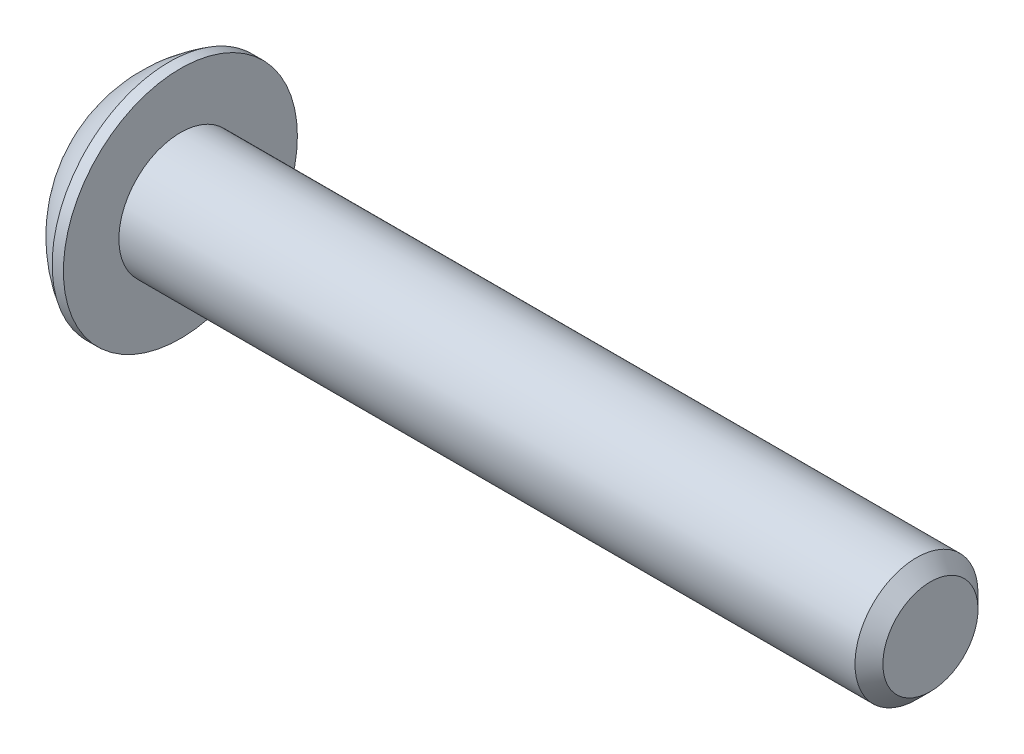
ISO-10303-21;
HEADER;
FILE_DESCRIPTION(('STEP AP214'),'2;1');
FILE_NAME('part.step','',(''),(''),'','','');
FILE_SCHEMA(('AUTOMOTIVE_DESIGN { 1 0 10303 214 1 1 1 1 }'));
ENDSEC;
DATA;
#1=APPLICATION_CONTEXT('core data for automotive mechanical design processes');
#2=APPLICATION_PROTOCOL_DEFINITION('international standard','automotive_design',2000,#1);
#3=PRODUCT_CONTEXT('',#1,'mechanical');
#4=PRODUCT('Part','Part','',(#3));
#5=PRODUCT_RELATED_PRODUCT_CATEGORY('part','',(#4));
#6=PRODUCT_DEFINITION_FORMATION('','',#4);
#7=PRODUCT_DEFINITION_CONTEXT('part definition',#1,'design');
#8=PRODUCT_DEFINITION('design','',#6,#7);
#9=PRODUCT_DEFINITION_SHAPE('','',#8);
#10=(LENGTH_UNIT() NAMED_UNIT(*) SI_UNIT(.MILLI.,.METRE.));
#11=(NAMED_UNIT(*) PLANE_ANGLE_UNIT() SI_UNIT($,.RADIAN.));
#12=(NAMED_UNIT(*) SI_UNIT($,.STERADIAN.) SOLID_ANGLE_UNIT());
#13=UNCERTAINTY_MEASURE_WITH_UNIT(LENGTH_MEASURE(1.E-05),#10,'distance_accuracy_value','');
#14=(GEOMETRIC_REPRESENTATION_CONTEXT(3) GLOBAL_UNCERTAINTY_ASSIGNED_CONTEXT((#13)) GLOBAL_UNIT_ASSIGNED_CONTEXT((#10,
#11,#12)) REPRESENTATION_CONTEXT('',''));
#15=CARTESIAN_POINT('',(0.,0.,0.));
#16=DIRECTION('',(0.,0.,1.));
#17=DIRECTION('',(1.,0.,0.));
#18=AXIS2_PLACEMENT_3D('',#15,#16,#17);
#19=CARTESIAN_POINT('',(1.32080000000034,0.,0.));
#20=DIRECTION('',(-1.,0.,0.));
#21=DIRECTION('',(0.,0.,-1.));
#22=AXIS2_PLACEMENT_3D('',#19,#20,#21);
#23=CONICAL_SURFACE('',#22,1.1937999999998,1.04719755119608);
#24=CARTESIAN_POINT('',(2.01004075135902,0.,-4.44089209850063E-13));
#25=VERTEX_POINT('',#24);
#26=VERTEX_LOOP('',#25);
#27=FACE_BOUND('',#26,.T.);
#28=CARTESIAN_POINT('',(1.32080000000009,0.,0.));
#29=DIRECTION('',(1.,0.,0.));
#30=DIRECTION('',(0.,0.,-1.));
#31=AXIS2_PLACEMENT_3D('',#28,#29,#30);
#32=CIRCLE('',#31,1.19380000000024);
#33=CARTESIAN_POINT('',(1.32080000000004,-1.03386112703797,-0.59690000000006));
#34=VERTEX_POINT('',#33);
#35=CARTESIAN_POINT('',(1.32080000000004,0.,-1.19380000000012));
#36=VERTEX_POINT('',#35);
#37=EDGE_CURVE('E37',#34,#36,#32,.T.);
#38=ORIENTED_EDGE('',*,*,#37,.F.);
#39=CARTESIAN_POINT('',(1.32080000000009,0.,0.));
#40=DIRECTION('',(1.,0.,0.));
#41=DIRECTION('',(0.,0.,-1.));
#42=AXIS2_PLACEMENT_3D('',#39,#40,#41);
#43=CIRCLE('',#42,1.19380000000024);
#44=CARTESIAN_POINT('',(1.32080000000004,-1.03386112703797,0.59690000000006));
#45=VERTEX_POINT('',#44);
#46=EDGE_CURVE('E127',#45,#34,#43,.T.);
#47=ORIENTED_EDGE('',*,*,#46,.F.);
#48=CARTESIAN_POINT('',(1.32080000000009,0.,0.));
#49=DIRECTION('',(1.,0.,0.));
#50=DIRECTION('',(0.,0.,-1.));
#51=AXIS2_PLACEMENT_3D('',#48,#49,#50);
#52=CIRCLE('',#51,1.19380000000024);
#53=CARTESIAN_POINT('',(1.32080000000004,1.49457637585666E-12,1.19380000000012));
#54=VERTEX_POINT('',#53);
#55=EDGE_CURVE('E133',#54,#45,#52,.T.);
#56=ORIENTED_EDGE('',*,*,#55,.F.);
#57=CARTESIAN_POINT('',(1.32080000000009,0.,0.));
#58=DIRECTION('',(1.,0.,0.));
#59=DIRECTION('',(0.,0.,-1.));
#60=AXIS2_PLACEMENT_3D('',#57,#58,#59);
#61=CIRCLE('',#60,1.19380000000024);
#62=CARTESIAN_POINT('',(1.32080000000004,1.03386112703797,0.596900000000061));
#63=VERTEX_POINT('',#62);
#64=EDGE_CURVE('E147',#63,#54,#61,.T.);
#65=ORIENTED_EDGE('',*,*,#64,.F.);
#66=CARTESIAN_POINT('',(1.32080000000009,0.,0.));
#67=DIRECTION('',(1.,0.,0.));
#68=DIRECTION('',(0.,0.,-1.));
#69=AXIS2_PLACEMENT_3D('',#66,#67,#68);
#70=CIRCLE('',#69,1.19380000000024);
#71=CARTESIAN_POINT('',(1.32080000000004,1.03386112703797,-0.596900000000061));
#72=VERTEX_POINT('',#71);
#73=EDGE_CURVE('E140',#72,#63,#70,.T.);
#74=ORIENTED_EDGE('',*,*,#73,.F.);
#75=CARTESIAN_POINT('',(1.32080000000009,0.,0.));
#76=DIRECTION('',(1.,0.,0.));
#77=DIRECTION('',(0.,0.,-1.));
#78=AXIS2_PLACEMENT_3D('',#75,#76,#77);
#79=CIRCLE('',#78,1.19380000000024);
#80=EDGE_CURVE('E137',#36,#72,#79,.T.);
#81=ORIENTED_EDGE('',*,*,#80,.F.);
#82=EDGE_LOOP('',(#38,#47,#56,#65,#74,#81));
#83=FACE_BOUND('',#82,.T.);
#84=ADVANCED_FACE('F34',(#27,#83),#23,.F.);
#85=CARTESIAN_POINT('',(1.3208,-2.06772225407572,1.1938));
#86=DIRECTION('',(1.,0.,0.));
#87=DIRECTION('',(0.,0.,1.));
#88=AXIS2_PLACEMENT_3D('',#85,#86,#87);
#89=PLANE('',#88);
#90=DIRECTION('',(0.,0.5,-0.866025403784439));
#91=VECTOR('',#90,1.);
#92=CARTESIAN_POINT('',(1.3208,-1.37848150271715,0.));
#93=LINE('',#92,#91);
#94=CARTESIAN_POINT('',(1.3208,-0.689240751358574,-1.1938));
#95=VERTEX_POINT('',#94);
#96=EDGE_CURVE('E109',#95,#34,#93,.F.);
#97=ORIENTED_EDGE('',*,*,#96,.T.);
#98=ORIENTED_EDGE('',*,*,#37,.T.);
#99=DIRECTION('',(0.,1.,0.));
#100=VECTOR('',#99,1.);
#101=CARTESIAN_POINT('',(1.3208,-0.689240751358574,-1.1938));
#102=LINE('',#101,#100);
#103=EDGE_CURVE('E124',#36,#95,#102,.F.);
#104=ORIENTED_EDGE('',*,*,#103,.T.);
#105=EDGE_LOOP('',(#97,#98,#104));
#106=FACE_BOUND('',#105,.T.);
#107=ADVANCED_FACE('F121',(#106),#89,.F.);
#108=CARTESIAN_POINT('',(1.3208,-2.06772225407572,1.1938));
#109=DIRECTION('',(1.,0.,0.));
#110=DIRECTION('',(0.,0.,1.));
#111=AXIS2_PLACEMENT_3D('',#108,#109,#110);
#112=PLANE('',#111);
#113=DIRECTION('',(0.,-0.5,-0.866025403784439));
#114=VECTOR('',#113,1.);
#115=CARTESIAN_POINT('',(1.3208,-0.689240751358574,1.1938));
#116=LINE('',#115,#114);
#117=CARTESIAN_POINT('',(1.3208,-1.37848150271715,0.));
#118=VERTEX_POINT('',#117);
#119=EDGE_CURVE('E129',#118,#45,#116,.F.);
#120=ORIENTED_EDGE('',*,*,#119,.T.);
#121=ORIENTED_EDGE('',*,*,#46,.T.);
#122=DIRECTION('',(0.,0.5,-0.866025403784439));
#123=VECTOR('',#122,1.);
#124=CARTESIAN_POINT('',(1.3208,-1.37848150271715,0.));
#125=LINE('',#124,#123);
#126=EDGE_CURVE('E104',#34,#118,#125,.F.);
#127=ORIENTED_EDGE('',*,*,#126,.T.);
#128=EDGE_LOOP('',(#120,#121,#127));
#129=FACE_BOUND('',#128,.T.);
#130=ADVANCED_FACE('F128',(#129),#112,.F.);
#131=CARTESIAN_POINT('',(1.3208,-2.06772225407572,1.1938));
#132=DIRECTION('',(1.,0.,0.));
#133=DIRECTION('',(0.,0.,1.));
#134=AXIS2_PLACEMENT_3D('',#131,#132,#133);
#135=PLANE('',#134);
#136=DIRECTION('',(0.,1.,0.));
#137=VECTOR('',#136,1.);
#138=CARTESIAN_POINT('',(1.3208,0.689240751358577,1.1938));
#139=LINE('',#138,#137);
#140=CARTESIAN_POINT('',(1.3208,-0.689240751358574,1.1938));
#141=VERTEX_POINT('',#140);
#142=EDGE_CURVE('E166',#141,#54,#139,.T.);
#143=ORIENTED_EDGE('',*,*,#142,.T.);
#144=ORIENTED_EDGE('',*,*,#55,.T.);
#145=DIRECTION('',(0.,-0.5,-0.866025403784439));
#146=VECTOR('',#145,1.);
#147=CARTESIAN_POINT('',(1.3208,-0.689240751358574,1.1938));
#148=LINE('',#147,#146);
#149=EDGE_CURVE('E164',#45,#141,#148,.F.);
#150=ORIENTED_EDGE('',*,*,#149,.T.);
#151=EDGE_LOOP('',(#143,#144,#150));
#152=FACE_BOUND('',#151,.T.);
#153=ADVANCED_FACE('F163',(#152),#135,.F.);
#154=CARTESIAN_POINT('',(1.3208,-2.06772225407572,1.1938));
#155=DIRECTION('',(1.,0.,0.));
#156=DIRECTION('',(0.,0.,1.));
#157=AXIS2_PLACEMENT_3D('',#154,#155,#156);
#158=PLANE('',#157);
#159=DIRECTION('',(0.,-0.5,0.866025403784439));
#160=VECTOR('',#159,1.);
#161=CARTESIAN_POINT('',(1.3208,1.37848150271715,0.));
#162=LINE('',#161,#160);
#163=CARTESIAN_POINT('',(1.3208,0.689240751358577,1.1938));
#164=VERTEX_POINT('',#163);
#165=EDGE_CURVE('E173',#164,#63,#162,.F.);
#166=ORIENTED_EDGE('',*,*,#165,.T.);
#167=ORIENTED_EDGE('',*,*,#64,.T.);
#168=DIRECTION('',(0.,1.,0.));
#169=VECTOR('',#168,1.);
#170=CARTESIAN_POINT('',(1.3208,0.689240751358577,1.1938));
#171=LINE('',#170,#169);
#172=EDGE_CURVE('E171',#54,#164,#171,.T.);
#173=ORIENTED_EDGE('',*,*,#172,.T.);
#174=EDGE_LOOP('',(#166,#167,#173));
#175=FACE_BOUND('',#174,.T.);
#176=ADVANCED_FACE('F170',(#175),#158,.F.);
#177=CARTESIAN_POINT('',(1.3208,-2.06772225407572,1.1938));
#178=DIRECTION('',(1.,0.,0.));
#179=DIRECTION('',(0.,0.,1.));
#180=AXIS2_PLACEMENT_3D('',#177,#178,#179);
#181=PLANE('',#180);
#182=DIRECTION('',(0.,0.5,0.866025403784439));
#183=VECTOR('',#182,1.);
#184=CARTESIAN_POINT('',(1.3208,0.689240751358576,-1.1938));
#185=LINE('',#184,#183);
#186=CARTESIAN_POINT('',(1.3208,1.37848150271715,0.));
#187=VERTEX_POINT('',#186);
#188=EDGE_CURVE('E184',#187,#72,#185,.F.);
#189=ORIENTED_EDGE('',*,*,#188,.T.);
#190=ORIENTED_EDGE('',*,*,#73,.T.);
#191=DIRECTION('',(0.,-0.5,0.866025403784439));
#192=VECTOR('',#191,1.);
#193=CARTESIAN_POINT('',(1.3208,1.37848150271715,0.));
#194=LINE('',#193,#192);
#195=EDGE_CURVE('E176',#63,#187,#194,.F.);
#196=ORIENTED_EDGE('',*,*,#195,.T.);
#197=EDGE_LOOP('',(#189,#190,#196));
#198=FACE_BOUND('',#197,.T.);
#199=ADVANCED_FACE('F182',(#198),#181,.F.);
#200=CARTESIAN_POINT('',(1.3208,-2.06772225407572,1.1938));
#201=DIRECTION('',(1.,0.,0.));
#202=DIRECTION('',(0.,0.,1.));
#203=AXIS2_PLACEMENT_3D('',#200,#201,#202);
#204=PLANE('',#203);
#205=DIRECTION('',(0.,1.,0.));
#206=VECTOR('',#205,1.);
#207=CARTESIAN_POINT('',(1.3208,-0.689240751358574,-1.1938));
#208=LINE('',#207,#206);
#209=CARTESIAN_POINT('',(1.3208,0.689240751358576,-1.1938));
#210=VERTEX_POINT('',#209);
#211=EDGE_CURVE('E144',#210,#36,#208,.F.);
#212=ORIENTED_EDGE('',*,*,#211,.T.);
#213=ORIENTED_EDGE('',*,*,#80,.T.);
#214=DIRECTION('',(0.,0.5,0.866025403784439));
#215=VECTOR('',#214,1.);
#216=CARTESIAN_POINT('',(1.3208,0.689240751358576,-1.1938));
#217=LINE('',#216,#215);
#218=EDGE_CURVE('E186',#72,#210,#217,.F.);
#219=ORIENTED_EDGE('',*,*,#218,.T.);
#220=EDGE_LOOP('',(#212,#213,#219));
#221=FACE_BOUND('',#220,.T.);
#222=ADVANCED_FACE('F307',(#221),#204,.F.);
#223=CARTESIAN_POINT('',(1.3208,-0.689240751358574,-1.1938));
#224=DIRECTION('',(0.,0.,1.));
#225=DIRECTION('',(0.,1.,0.));
#226=AXIS2_PLACEMENT_3D('',#223,#224,#225);
#227=PLANE('',#226);
#228=DIRECTION('',(0.,1.,0.));
#229=VECTOR('',#228,1.);
#230=CARTESIAN_POINT('',(0.,0.,-1.1938));
#231=LINE('',#230,#229);
#232=CARTESIAN_POINT('',(0.,0.689240751358577,-1.1938));
#233=VERTEX_POINT('',#232);
#234=CARTESIAN_POINT('',(0.,-0.689240751358574,-1.1938));
#235=VERTEX_POINT('',#234);
#236=EDGE_CURVE('E194',#233,#235,#231,.F.);
#237=ORIENTED_EDGE('',*,*,#236,.T.);
#238=DIRECTION('',(1.,0.,0.));
#239=VECTOR('',#238,1.);
#240=CARTESIAN_POINT('',(1.3208,-0.689240751358574,-1.1938));
#241=LINE('',#240,#239);
#242=EDGE_CURVE('E116',#235,#95,#241,.T.);
#243=ORIENTED_EDGE('',*,*,#242,.T.);
#244=ORIENTED_EDGE('',*,*,#103,.F.);
#245=ORIENTED_EDGE('',*,*,#211,.F.);
#246=DIRECTION('',(1.,0.,0.));
#247=VECTOR('',#246,1.);
#248=CARTESIAN_POINT('',(1.3208,0.689240751358576,-1.1938));
#249=LINE('',#248,#247);
#250=EDGE_CURVE('E189',#210,#233,#249,.F.);
#251=ORIENTED_EDGE('',*,*,#250,.T.);
#252=EDGE_LOOP('',(#237,#243,#244,#245,#251));
#253=FACE_BOUND('',#252,.T.);
#254=ADVANCED_FACE('F273',(#253),#227,.T.);
#255=CARTESIAN_POINT('',(1.3208,-1.37848150271715,0.));
#256=DIRECTION('',(0.,0.866025403784439,0.5));
#257=DIRECTION('',(0.,0.5,-0.866025403784439));
#258=AXIS2_PLACEMENT_3D('',#255,#256,#257);
#259=PLANE('',#258);
#260=DIRECTION('',(0.,-0.5,0.866025403784439));
#261=VECTOR('',#260,1.);
#262=CARTESIAN_POINT('',(0.,-0.689240751358574,-1.1938));
#263=LINE('',#262,#261);
#264=CARTESIAN_POINT('',(0.,-1.37848150271715,0.));
#265=VERTEX_POINT('',#264);
#266=EDGE_CURVE('E270',#235,#265,#263,.T.);
#267=ORIENTED_EDGE('',*,*,#266,.T.);
#268=DIRECTION('',(1.,0.,0.));
#269=VECTOR('',#268,1.);
#270=CARTESIAN_POINT('',(1.3208,-1.37848150271715,0.));
#271=LINE('',#270,#269);
#272=EDGE_CURVE('E111',#265,#118,#271,.T.);
#273=ORIENTED_EDGE('',*,*,#272,.T.);
#274=ORIENTED_EDGE('',*,*,#126,.F.);
#275=ORIENTED_EDGE('',*,*,#96,.F.);
#276=ORIENTED_EDGE('',*,*,#242,.F.);
#277=EDGE_LOOP('',(#267,#273,#274,#275,#276));
#278=FACE_BOUND('',#277,.T.);
#279=ADVANCED_FACE('F107',(#278),#259,.T.);
#280=CARTESIAN_POINT('',(1.3208,-0.689240751358574,1.1938));
#281=DIRECTION('',(0.,0.866025403784439,-0.5));
#282=DIRECTION('',(0.,-0.5,-0.866025403784439));
#283=AXIS2_PLACEMENT_3D('',#280,#281,#282);
#284=PLANE('',#283);
#285=DIRECTION('',(0.,0.5,0.866025403784439));
#286=VECTOR('',#285,1.);
#287=CARTESIAN_POINT('',(0.,-1.37848150271715,0.));
#288=LINE('',#287,#286);
#289=CARTESIAN_POINT('',(0.,-0.689240751358574,1.1938));
#290=VERTEX_POINT('',#289);
#291=EDGE_CURVE('E268',#265,#290,#288,.T.);
#292=ORIENTED_EDGE('',*,*,#291,.T.);
#293=DIRECTION('',(1.,0.,0.));
#294=VECTOR('',#293,1.);
#295=CARTESIAN_POINT('',(1.3208,-0.689240751358574,1.1938));
#296=LINE('',#295,#294);
#297=EDGE_CURVE('E177',#290,#141,#296,.T.);
#298=ORIENTED_EDGE('',*,*,#297,.T.);
#299=ORIENTED_EDGE('',*,*,#149,.F.);
#300=ORIENTED_EDGE('',*,*,#119,.F.);
#301=ORIENTED_EDGE('',*,*,#272,.F.);
#302=EDGE_LOOP('',(#292,#298,#299,#300,#301));
#303=FACE_BOUND('',#302,.T.);
#304=ADVANCED_FACE('F278',(#303),#284,.T.);
#305=CARTESIAN_POINT('',(1.3208,0.689240751358577,1.1938));
#306=DIRECTION('',(0.,0.,-1.));
#307=DIRECTION('',(1.,0.,0.));
#308=AXIS2_PLACEMENT_3D('',#305,#306,#307);
#309=PLANE('',#308);
#310=DIRECTION('',(0.,1.,0.));
#311=VECTOR('',#310,1.);
#312=CARTESIAN_POINT('',(0.,0.,1.1938));
#313=LINE('',#312,#311);
#314=CARTESIAN_POINT('',(0.,0.689240751358577,1.1938));
#315=VERTEX_POINT('',#314);
#316=EDGE_CURVE('E260',#290,#315,#313,.T.);
#317=ORIENTED_EDGE('',*,*,#316,.T.);
#318=DIRECTION('',(1.,0.,0.));
#319=VECTOR('',#318,1.);
#320=CARTESIAN_POINT('',(1.3208,0.689240751358577,1.1938));
#321=LINE('',#320,#319);
#322=EDGE_CURVE('E187',#315,#164,#321,.T.);
#323=ORIENTED_EDGE('',*,*,#322,.T.);
#324=ORIENTED_EDGE('',*,*,#172,.F.);
#325=ORIENTED_EDGE('',*,*,#142,.F.);
#326=ORIENTED_EDGE('',*,*,#297,.F.);
#327=EDGE_LOOP('',(#317,#323,#324,#325,#326));
#328=FACE_BOUND('',#327,.T.);
#329=ADVANCED_FACE('F280',(#328),#309,.T.);
#330=CARTESIAN_POINT('',(1.3208,1.37848150271715,0.));
#331=DIRECTION('',(0.,-0.866025403784439,-0.5));
#332=DIRECTION('',(0.,-0.5,0.866025403784439));
#333=AXIS2_PLACEMENT_3D('',#330,#331,#332);
#334=PLANE('',#333);
#335=DIRECTION('',(0.,0.5,-0.866025403784439));
#336=VECTOR('',#335,1.);
#337=CARTESIAN_POINT('',(0.,0.689240751358577,1.1938));
#338=LINE('',#337,#336);
#339=CARTESIAN_POINT('',(0.,1.37848150271715,0.));
#340=VERTEX_POINT('',#339);
#341=EDGE_CURVE('E257',#315,#340,#338,.T.);
#342=ORIENTED_EDGE('',*,*,#341,.T.);
#343=DIRECTION('',(1.,0.,0.));
#344=VECTOR('',#343,1.);
#345=CARTESIAN_POINT('',(1.3208,1.37848150271715,0.));
#346=LINE('',#345,#344);
#347=EDGE_CURVE('E202',#340,#187,#346,.T.);
#348=ORIENTED_EDGE('',*,*,#347,.T.);
#349=ORIENTED_EDGE('',*,*,#195,.F.);
#350=ORIENTED_EDGE('',*,*,#165,.F.);
#351=ORIENTED_EDGE('',*,*,#322,.F.);
#352=EDGE_LOOP('',(#342,#348,#349,#350,#351));
#353=FACE_BOUND('',#352,.T.);
#354=ADVANCED_FACE('F281',(#353),#334,.T.);
#355=CARTESIAN_POINT('',(1.3208,0.689240751358576,-1.1938));
#356=DIRECTION('',(0.,-0.866025403784439,0.5));
#357=DIRECTION('',(0.,0.5,0.866025403784439));
#358=AXIS2_PLACEMENT_3D('',#355,#356,#357);
#359=PLANE('',#358);
#360=DIRECTION('',(0.,-0.5,-0.866025403784439));
#361=VECTOR('',#360,1.);
#362=CARTESIAN_POINT('',(0.,1.37848150271715,0.));
#363=LINE('',#362,#361);
#364=EDGE_CURVE('E52',#340,#233,#363,.T.);
#365=ORIENTED_EDGE('',*,*,#364,.T.);
#366=ORIENTED_EDGE('',*,*,#250,.F.);
#367=ORIENTED_EDGE('',*,*,#218,.F.);
#368=ORIENTED_EDGE('',*,*,#188,.F.);
#369=ORIENTED_EDGE('',*,*,#347,.F.);
#370=EDGE_LOOP('',(#365,#366,#367,#368,#369));
#371=FACE_BOUND('',#370,.T.);
#372=ADVANCED_FACE('F282',(#371),#359,.T.);
#373=CARTESIAN_POINT('',(0.,0.,0.));
#374=DIRECTION('',(-1.,0.,0.));
#375=DIRECTION('',(0.,0.,-1.));
#376=AXIS2_PLACEMENT_3D('',#373,#374,#375);
#377=PLANE('',#376);
#378=ORIENTED_EDGE('',*,*,#341,.F.);
#379=ORIENTED_EDGE('',*,*,#316,.F.);
#380=ORIENTED_EDGE('',*,*,#291,.F.);
#381=ORIENTED_EDGE('',*,*,#266,.F.);
#382=ORIENTED_EDGE('',*,*,#236,.F.);
#383=ORIENTED_EDGE('',*,*,#364,.F.);
#384=EDGE_LOOP('',(#378,#379,#380,#381,#382,#383));
#385=FACE_BOUND('',#384,.T.);
#386=CARTESIAN_POINT('',(0.,1.9812,0.));
#387=CARTESIAN_POINT('',(0.,1.9811996664299,-0.0556258831179428));
#388=CARTESIAN_POINT('',(0.,1.97885520380442,-0.111261989398606));
#389=CARTESIAN_POINT('',(0.,1.96949260169541,-0.222149719830458));
#390=CARTESIAN_POINT('',(0.,1.96247308239605,-0.277401225602895));
#391=CARTESIAN_POINT('',(0.,1.94379192841038,-0.387209508139747));
#392=CARTESIAN_POINT('',(-1.85325793235264E-13,1.93212292489526,-0.441765039546365));
#393=CARTESIAN_POINT('',(1.86344214223505E-13,1.90422331175315,-0.549729449347493));
#394=CARTESIAN_POINT('',(6.94543371897454E-13,1.88798900035338,-0.603137359208869));
#395=CARTESIAN_POINT('',(1.15501975216981E-12,1.83266214476501,-0.760839131321828));
#396=CARTESIAN_POINT('',(0.,1.78690023648845,-0.862876433575429));
#397=CARTESIAN_POINT('',(0.,1.67887358150667,-1.05780719540872));
#398=CARTESIAN_POINT('',(9.54193214892627E-13,1.6166082074585,-1.15070030720801));
#399=CARTESIAN_POINT('',(5.94805591894675E-13,1.51224157140982,-1.28116890915697));
#400=CARTESIAN_POINT('',(1.63221293851378E-13,1.4755970394354,-1.32320451127026));
#401=CARTESIAN_POINT('',(-1.62196980336157E-13,1.39893832619713,-1.40400288695709));
#402=CARTESIAN_POINT('',(0.,1.35892742784698,-1.44276877695455));
#403=CARTESIAN_POINT('',(1.14362537325405E-13,1.23416504602197,-1.55382272417904));
#404=CARTESIAN_POINT('',(0.,1.14466125559859,-1.62089527952111));
#405=CARTESIAN_POINT('',(0.,0.955712144178167,-1.7390221808118));
#406=CARTESIAN_POINT('',(0.,0.856267198233564,-1.79007713076007));
#407=CARTESIAN_POINT('',(0.,0.650206345910843,-1.87477637530954));
#408=CARTESIAN_POINT('',(0.,0.543590516134855,-1.90842085586267));
#409=CARTESIAN_POINT('',(0.,0.326226155292018,-1.95733039300656));
#410=CARTESIAN_POINT('',(0.,0.21547760215793,-1.97259535144288));
#411=CARTESIAN_POINT('',(0.,-0.00701040587544633,-1.98431697865418));
#412=CARTESIAN_POINT('',(0.,-0.118749860774734,-1.98077364742917));
#413=CARTESIAN_POINT('',(0.,-0.340050178355485,-1.95497485623825));
#414=CARTESIAN_POINT('',(0.,-0.449611052668256,-1.93271949620218));
#415=CARTESIAN_POINT('',(0.,-0.663431110729174,-1.87014138774524));
#416=CARTESIAN_POINT('',(0.,-0.76769023783852,-1.82981844635272));
#417=CARTESIAN_POINT('',(0.,-0.968005760719347,-1.73219968377096));
#418=CARTESIAN_POINT('',(0.,-1.0640618469811,-1.6749032225164));
#419=CARTESIAN_POINT('',(0.,-1.19980276751283,-1.57757371205873));
#420=CARTESIAN_POINT('',(0.,-1.24366557129213,-1.54322665019466));
#421=CARTESIAN_POINT('',(0.,-1.32838995706696,-1.47093063174264));
#422=CARTESIAN_POINT('',(0.,-1.36924860178706,-1.43297823102439));
#423=CARTESIAN_POINT('',(0.,-1.48674671849223,-1.31419842051173));
#424=CARTESIAN_POINT('',(0.,-1.55842832343237,-1.22836221289311));
#425=CARTESIAN_POINT('',(0.,-1.6863396856475,-1.04586168272493));
#426=CARTESIAN_POINT('',(0.,-1.7425700302488,-0.949197771949775));
#427=CARTESIAN_POINT('',(0.,-1.8141614250401,-0.798182600298684));
#428=CARTESIAN_POINT('',(0.,-1.83591780585875,-0.74677620384779));
#429=CARTESIAN_POINT('',(0.,-1.87500754181092,-0.642341081688635));
#430=CARTESIAN_POINT('',(0.,-1.89234447645404,-0.589313708122846));
#431=CARTESIAN_POINT('',(0.,-1.92246053433555,-0.482076273028395));
#432=CARTESIAN_POINT('',(0.,-1.93524685475118,-0.42786822425751));
#433=CARTESIAN_POINT('',(0.,-1.95620937250494,-0.318578151844611));
#434=CARTESIAN_POINT('',(0.,-1.96438692958147,-0.263496390912872));
#435=CARTESIAN_POINT('',(0.,-1.97388528284653,-0.173607715038558));
#436=CARTESIAN_POINT('',(0.,-1.97662743364426,-0.138944718024998));
#437=CARTESIAN_POINT('',(0.,-1.98028489645283,-0.0695224782567002));
#438=CARTESIAN_POINT('',(0.,-1.98120020846367,-0.0347632355019631));
#439=CARTESIAN_POINT('',(0.,-1.9811996664299,0.0556258831179437));
#440=CARTESIAN_POINT('',(0.,-1.97885520380442,0.111261989398607));
#441=CARTESIAN_POINT('',(0.,-1.96949260169541,0.222149719830459));
#442=CARTESIAN_POINT('',(0.,-1.96247308239606,0.277401225602897));
#443=CARTESIAN_POINT('',(0.,-1.94379192841039,0.38720950813975));
#444=CARTESIAN_POINT('',(-1.85269749640692E-13,-1.93212292489526,0.441765039546367));
#445=CARTESIAN_POINT('',(1.86288125054388E-13,-1.90422331175315,0.549729449347495));
#446=CARTESIAN_POINT('',(6.94525090263764E-13,-1.88798900035338,0.603137359208872));
#447=CARTESIAN_POINT('',(1.15505622829081E-12,-1.83266214476501,0.760839131321831));
#448=CARTESIAN_POINT('',(0.,-1.78690023648845,0.862876433575431));
#449=CARTESIAN_POINT('',(0.,-1.67887358150667,1.05780719540872));
#450=CARTESIAN_POINT('',(9.5424881286938E-13,-1.6166082074585,1.15070030720801));
#451=CARTESIAN_POINT('',(5.94777756479239E-13,-1.51224157140982,1.28116890915698));
#452=CARTESIAN_POINT('',(1.63138949183833E-13,-1.47559703943539,1.32320451127027));
#453=CARTESIAN_POINT('',(-1.62114715061273E-13,-1.39893832619713,1.40400288695709));
#454=CARTESIAN_POINT('',(0.,-1.35892742784699,1.44276877695455));
#455=CARTESIAN_POINT('',(1.13760489124207E-13,-1.23416504602197,1.55382272417904));
#456=CARTESIAN_POINT('',(0.,-1.14466125559859,1.62089527952111));
#457=CARTESIAN_POINT('',(0.,-0.95571214417816,1.73902218081179));
#458=CARTESIAN_POINT('',(0.,-0.856267198233559,1.79007713076007));
#459=CARTESIAN_POINT('',(0.,-0.65020634591084,1.87477637530954));
#460=CARTESIAN_POINT('',(0.,-0.543590516134854,1.90842085586267));
#461=CARTESIAN_POINT('',(0.,-0.326226155292018,1.95733039300657));
#462=CARTESIAN_POINT('',(0.,-0.215477602157929,1.97259535144288));
#463=CARTESIAN_POINT('',(0.,0.00701040587544865,1.98431697865418));
#464=CARTESIAN_POINT('',(0.,0.118749860774737,1.98077364742916));
#465=CARTESIAN_POINT('',(0.,0.340050178355489,1.95497485623824));
#466=CARTESIAN_POINT('',(0.,0.44961105266826,1.93271949620218));
#467=CARTESIAN_POINT('',(0.,0.663431110729178,1.87014138774524));
#468=CARTESIAN_POINT('',(0.,0.767690237838524,1.82981844635272));
#469=CARTESIAN_POINT('',(0.,0.968005760719347,1.73219968377096));
#470=CARTESIAN_POINT('',(0.,1.0640618469811,1.67490322251639));
#471=CARTESIAN_POINT('',(0.,1.19980276751283,1.57757371205873));
#472=CARTESIAN_POINT('',(0.,1.24366557129214,1.54322665019465));
#473=CARTESIAN_POINT('',(0.,1.32838995706696,1.47093063174263));
#474=CARTESIAN_POINT('',(0.,1.36924860178706,1.43297823102439));
#475=CARTESIAN_POINT('',(0.,1.48674671849223,1.31419842051172));
#476=CARTESIAN_POINT('',(0.,1.55842832343237,1.22836221289311));
#477=CARTESIAN_POINT('',(0.,1.6863396856475,1.04586168272492));
#478=CARTESIAN_POINT('',(0.,1.7425700302488,0.949197771949768));
#479=CARTESIAN_POINT('',(0.,1.8141614250401,0.798182600298677));
#480=CARTESIAN_POINT('',(0.,1.83591780585875,0.746776203847785));
#481=CARTESIAN_POINT('',(0.,1.87500754181092,0.64234108168863));
#482=CARTESIAN_POINT('',(0.,1.89234447645404,0.589313708122841));
#483=CARTESIAN_POINT('',(0.,1.92246053433555,0.482076273028389));
#484=CARTESIAN_POINT('',(0.,1.93524685475118,0.427868224257504));
#485=CARTESIAN_POINT('',(0.,1.95620937250494,0.318578151844605));
#486=CARTESIAN_POINT('',(0.,1.96438692958147,0.263496390912866));
#487=CARTESIAN_POINT('',(0.,1.97388528284653,0.173607715038553));
#488=CARTESIAN_POINT('',(0.,1.97662743364426,0.138944718024994));
#489=CARTESIAN_POINT('',(0.,1.98028489645283,0.0695224782566989));
#490=CARTESIAN_POINT('',(0.,1.98120020846367,0.034763235501963));
#491=CARTESIAN_POINT('',(0.,1.9812,0.));
#492=B_SPLINE_CURVE_WITH_KNOTS('',3,(#386,#387,#388,#389,#390,#391,#392,#393,#394,#395,#396,
#397,#398,#399,#400,#401,#402,#403,#404,#405,#406,#407,#408,#409,#410,#411,#412,#413,#414,#415,
#416,#417,#418,#419,#420,#421,#422,#423,#424,#425,#426,#427,#428,#429,#430,#431,#432,#433,#434,
#435,#436,#437,#438,#439,#440,#441,#442,#443,#444,#445,#446,#447,#448,#449,#450,#451,#452,#453,
#454,#455,#456,#457,#458,#459,#460,#461,#462,#463,#464,#465,#466,#467,#468,#469,#470,#471,#472,
#473,#474,#475,#476,#477,#478,#479,#480,#481,#482,#483,#484,#485,#486,#487,#488,#489,#490,#491),
.UNSPECIFIED.,.T.,.F.,(4,2,2,2,2,2,2,2,2,2,2,2,2,2,2,2,2,2,2,2,2,2,2,2,2,2,2,2,2,2,2,2,2,2,2,2,
2,2,2,2,2,2,2,2,2,2,2,2,2,2,2,2,4),(0.,0.166845646007828,0.333740557374255,0.500901034367693,
0.668197445942386,1.00199278686282,1.33580081809885,1.50292354032982,1.6698851310853,
2.00370118900129,2.33750465770544,2.67130456115909,3.00510624723801,3.33890793331696,
3.67270783677065,4.00651130547476,4.34032736339026,4.50728895414554,4.67441167637632,
5.00821970761259,5.34201504853332,5.50931146010827,5.67647193710191,5.84336684846844,
6.0102124944764,6.11448220058334,6.21875190669029,6.38559755269812,6.55249246406454,
6.71965294105798,6.88694935263268,7.22074469355311,7.55455272478915,7.72167544702011,
7.88863703777559,8.22245309569158,8.55625656439573,8.89005646784938,9.2238581539283,
9.55765984000725,9.89145974346094,10.2252632121651,10.5590792700806,10.7260408608358,
10.8931635830666,11.2269716143029,11.5607669552236,11.7280633667986,11.8952238437922,
12.0621187551587,12.2289644011667,12.3332341072736,12.4375038133806),.UNSPECIFIED.);
#493=CARTESIAN_POINT('',(0.,1.9812,0.));
#494=VERTEX_POINT('',#493);
#495=EDGE_CURVE('E150',#494,#494,#492,.T.);
#496=ORIENTED_EDGE('',*,*,#495,.T.);
#497=EDGE_LOOP('',(#496));
#498=FACE_BOUND('',#497,.T.);
#499=ADVANCED_FACE('F275',(#385,#498),#377,.T.);
#500=CARTESIAN_POINT('',(4.13385,0.,0.));
#501=DIRECTION('',(0.,1.,0.));
#502=DIRECTION('',(1.,0.,0.));
#503=AXIS2_PLACEMENT_3D('',#500,#501,#502);
#504=SPHERICAL_SURFACE('',#503,4.58408870578439);
#505=CARTESIAN_POINT('',(1.8288,0.,0.));
#506=DIRECTION('',(1.,0.,0.));
#507=DIRECTION('',(0.,0.,-1.));
#508=AXIS2_PLACEMENT_3D('',#505,#506,#507);
#509=CIRCLE('',#508,3.9624);
#510=CARTESIAN_POINT('',(1.8288,0.,-3.9624));
#511=VERTEX_POINT('',#510);
#512=EDGE_CURVE('E250',#511,#511,#509,.F.);
#513=ORIENTED_EDGE('',*,*,#512,.T.);
#514=EDGE_LOOP('',(#513));
#515=FACE_BOUND('',#514,.T.);
#516=ORIENTED_EDGE('',*,*,#495,.F.);
#517=EDGE_LOOP('',(#516));
#518=FACE_BOUND('',#517,.T.);
#519=ADVANCED_FACE('F289',(#515,#518),#504,.T.);
#520=CARTESIAN_POINT('',(27.6098,0.,0.));
#521=DIRECTION('',(-1.,0.,0.));
#522=DIRECTION('',(0.,0.,-1.));
#523=AXIS2_PLACEMENT_3D('',#520,#521,#522);
#524=PLANE('',#523);
#525=CARTESIAN_POINT('',(27.6097999999365,0.,0.));
#526=DIRECTION('',(1.,0.,0.));
#527=DIRECTION('',(0.,-1.,0.));
#528=AXIS2_PLACEMENT_3D('',#525,#526,#527);
#529=CIRCLE('',#528,1.61036000002923);
#530=CARTESIAN_POINT('',(27.6097999999365,-1.61036000002923,0.));
#531=VERTEX_POINT('',#530);
#532=EDGE_CURVE('E248',#531,#531,#529,.T.);
#533=ORIENTED_EDGE('',*,*,#532,.T.);
#534=EDGE_LOOP('',(#533));
#535=FACE_BOUND('',#534,.T.);
#536=ADVANCED_FACE('F346',(#535),#524,.F.);
#537=CARTESIAN_POINT('',(0.,0.,0.));
#538=DIRECTION('',(-1.,0.,0.));
#539=DIRECTION('',(0.,0.,-1.));
#540=AXIS2_PLACEMENT_3D('',#537,#538,#539);
#541=CYLINDRICAL_SURFACE('',#540,3.9624);
#542=ORIENTED_EDGE('',*,*,#512,.F.);
#543=EDGE_LOOP('',(#542));
#544=FACE_BOUND('',#543,.T.);
#545=CARTESIAN_POINT('',(2.2098,0.,0.));
#546=DIRECTION('',(1.,0.,0.));
#547=DIRECTION('',(0.,0.,-1.));
#548=AXIS2_PLACEMENT_3D('',#545,#546,#547);
#549=CIRCLE('',#548,3.9624);
#550=CARTESIAN_POINT('',(2.2098,0.,-3.9624));
#551=VERTEX_POINT('',#550);
#552=EDGE_CURVE('E245',#551,#551,#549,.T.);
#553=ORIENTED_EDGE('',*,*,#552,.F.);
#554=EDGE_LOOP('',(#553));
#555=FACE_BOUND('',#554,.T.);
#556=ADVANCED_FACE('F354',(#544,#555),#541,.T.);
#557=CARTESIAN_POINT('',(27.1373600000402,0.,0.));
#558=DIRECTION('',(-1.,0.,0.));
#559=DIRECTION('',(0.,-1.,0.));
#560=AXIS2_PLACEMENT_3D('',#557,#558,#559);
#561=CONICAL_SURFACE('',#560,2.08279999992556,0.785398163397448);
#562=ORIENTED_EDGE('',*,*,#532,.F.);
#563=EDGE_LOOP('',(#562));
#564=FACE_BOUND('',#563,.T.);
#565=CARTESIAN_POINT('',(27.13736,0.,0.));
#566=DIRECTION('',(1.,0.,0.));
#567=DIRECTION('',(0.,0.,-1.));
#568=AXIS2_PLACEMENT_3D('',#565,#566,#567);
#569=CIRCLE('',#568,2.0828);
#570=CARTESIAN_POINT('',(27.13736,0.,-2.0828));
#571=VERTEX_POINT('',#570);
#572=EDGE_CURVE('E43',#571,#571,#569,.T.);
#573=ORIENTED_EDGE('',*,*,#572,.T.);
#574=EDGE_LOOP('',(#573));
#575=FACE_BOUND('',#574,.T.);
#576=ADVANCED_FACE('F364',(#564,#575),#561,.T.);
#577=CARTESIAN_POINT('',(2.2098,2.0828,0.));
#578=DIRECTION('',(-1.,0.,0.));
#579=DIRECTION('',(0.,0.,-1.));
#580=AXIS2_PLACEMENT_3D('',#577,#578,#579);
#581=PLANE('',#580);
#582=CARTESIAN_POINT('',(2.2098,0.,0.));
#583=DIRECTION('',(1.,0.,0.));
#584=DIRECTION('',(0.,0.,-1.));
#585=AXIS2_PLACEMENT_3D('',#582,#583,#584);
#586=CIRCLE('',#585,2.0828);
#587=CARTESIAN_POINT('',(2.2098,0.,-2.0828));
#588=VERTEX_POINT('',#587);
#589=EDGE_CURVE('E11',#588,#588,#586,.F.);
#590=ORIENTED_EDGE('',*,*,#589,.T.);
#591=EDGE_LOOP('',(#590));
#592=FACE_BOUND('',#591,.T.);
#593=ORIENTED_EDGE('',*,*,#552,.T.);
#594=EDGE_LOOP('',(#593));
#595=FACE_BOUND('',#594,.T.);
#596=ADVANCED_FACE('F374',(#592,#595),#581,.F.);
#597=CARTESIAN_POINT('',(0.,0.,0.));
#598=DIRECTION('',(-1.,0.,0.));
#599=DIRECTION('',(0.,0.,-1.));
#600=AXIS2_PLACEMENT_3D('',#597,#598,#599);
#601=CYLINDRICAL_SURFACE('',#600,2.0828);
#602=ORIENTED_EDGE('',*,*,#572,.F.);
#603=EDGE_LOOP('',(#602));
#604=FACE_BOUND('',#603,.T.);
#605=ORIENTED_EDGE('',*,*,#589,.F.);
#606=EDGE_LOOP('',(#605));
#607=FACE_BOUND('',#606,.T.);
#608=ADVANCED_FACE('F384',(#604,#607),#601,.T.);
#609=CLOSED_SHELL('',(#84,#107,#130,#153,#176,#199,#222,#254,#279,#304,#329,#354,#372,#499,#519,
#536,#556,#576,#596,#608));
#610=MANIFOLD_SOLID_BREP('B2',#609);
#611=ADVANCED_BREP_SHAPE_REPRESENTATION('',(#18,#610),#14);
#612=SHAPE_DEFINITION_REPRESENTATION(#9,#611);
ENDSEC;
END-ISO-10303-21;
